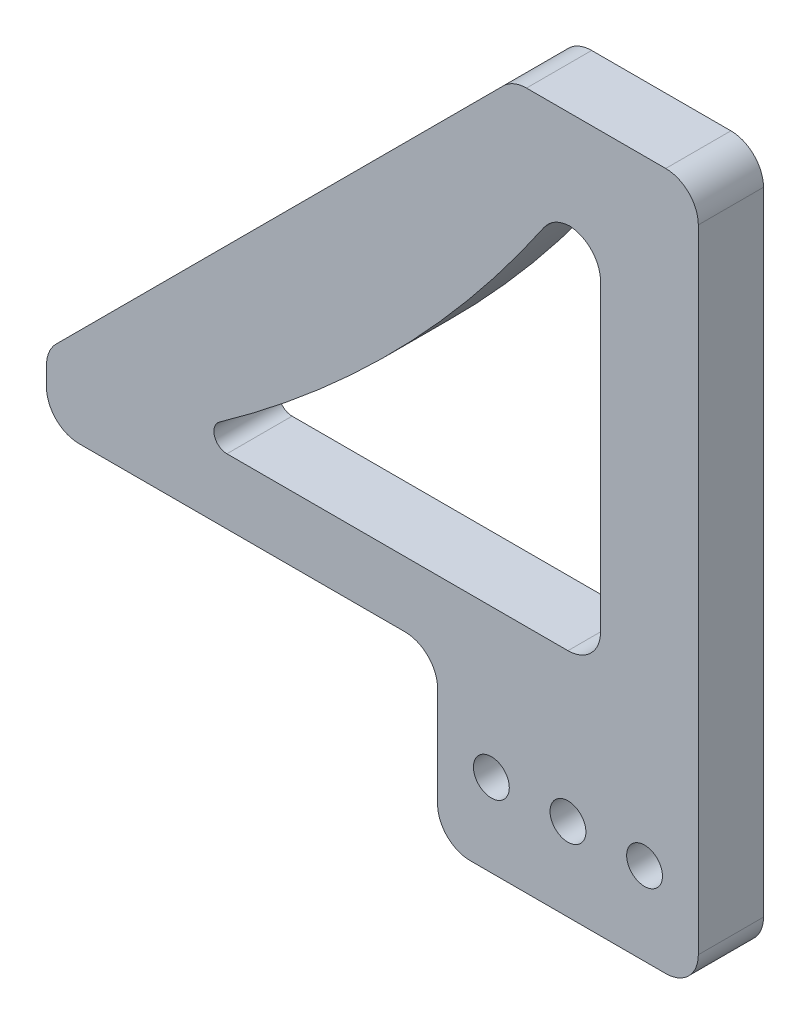
ISO-10303-21;
HEADER;
FILE_DESCRIPTION(('STEP AP214'),'2;1');
FILE_NAME('part.step','',(''),(''),'','','');
FILE_SCHEMA(('AUTOMOTIVE_DESIGN { 1 0 10303 214 1 1 1 1 }'));
ENDSEC;
DATA;
#1=APPLICATION_CONTEXT('core data for automotive mechanical design processes');
#2=APPLICATION_PROTOCOL_DEFINITION('international standard','automotive_design',2000,#1);
#3=PRODUCT_CONTEXT('',#1,'mechanical');
#4=PRODUCT('Part','Part','',(#3));
#5=PRODUCT_RELATED_PRODUCT_CATEGORY('part','',(#4));
#6=PRODUCT_DEFINITION_FORMATION('','',#4);
#7=PRODUCT_DEFINITION_CONTEXT('part definition',#1,'design');
#8=PRODUCT_DEFINITION('design','',#6,#7);
#9=PRODUCT_DEFINITION_SHAPE('','',#8);
#10=(LENGTH_UNIT() NAMED_UNIT(*) SI_UNIT(.MILLI.,.METRE.));
#11=(NAMED_UNIT(*) PLANE_ANGLE_UNIT() SI_UNIT($,.RADIAN.));
#12=(NAMED_UNIT(*) SI_UNIT($,.STERADIAN.) SOLID_ANGLE_UNIT());
#13=UNCERTAINTY_MEASURE_WITH_UNIT(LENGTH_MEASURE(1.E-05),#10,'distance_accuracy_value','');
#14=(GEOMETRIC_REPRESENTATION_CONTEXT(3) GLOBAL_UNCERTAINTY_ASSIGNED_CONTEXT((#13)) GLOBAL_UNIT_ASSIGNED_CONTEXT((#10,
#11,#12)) REPRESENTATION_CONTEXT('',''));
#15=CARTESIAN_POINT('',(0.,0.,0.));
#16=DIRECTION('',(0.,0.,1.));
#17=DIRECTION('',(1.,0.,0.));
#18=AXIS2_PLACEMENT_3D('',#15,#16,#17);
#19=CARTESIAN_POINT('',(0.,0.,10.));
#20=DIRECTION('',(0.,0.,-1.));
#21=DIRECTION('',(-1.,0.,0.));
#22=AXIS2_PLACEMENT_3D('',#19,#20,#21);
#23=PLANE('',#22);
#24=DIRECTION('',(0.,-1.,0.));
#25=VECTOR('',#24,1.);
#26=CARTESIAN_POINT('',(-60.,0.,10.));
#27=LINE('',#26,#25);
#28=CARTESIAN_POINT('',(-60.,7.92893218813452,10.));
#29=VERTEX_POINT('',#28);
#30=CARTESIAN_POINT('',(-60.,4.99999999999999,10.));
#31=VERTEX_POINT('',#30);
#32=EDGE_CURVE('E320',#29,#31,#27,.T.);
#33=ORIENTED_EDGE('',*,*,#32,.T.);
#34=CARTESIAN_POINT('',(-55.,4.99999999999999,10.));
#35=DIRECTION('',(0.,0.,-1.));
#36=DIRECTION('',(-1.,0.,0.));
#37=AXIS2_PLACEMENT_3D('',#34,#35,#36);
#38=CIRCLE('',#37,5.);
#39=CARTESIAN_POINT('',(-55.,0.,10.));
#40=VERTEX_POINT('',#39);
#41=EDGE_CURVE('E252',#31,#40,#38,.F.);
#42=ORIENTED_EDGE('',*,*,#41,.T.);
#43=DIRECTION('',(1.,0.,0.));
#44=VECTOR('',#43,1.);
#45=CARTESIAN_POINT('',(0.,0.,10.));
#46=LINE('',#45,#44);
#47=CARTESIAN_POINT('',(-5.,0.,10.));
#48=VERTEX_POINT('',#47);
#49=EDGE_CURVE('E323',#40,#48,#46,.T.);
#50=ORIENTED_EDGE('',*,*,#49,.T.);
#51=CARTESIAN_POINT('',(-5.,-5.,10.));
#52=DIRECTION('',(0.,0.,-1.));
#53=DIRECTION('',(-1.,0.,0.));
#54=AXIS2_PLACEMENT_3D('',#51,#52,#53);
#55=CIRCLE('',#54,5.);
#56=CARTESIAN_POINT('',(0.,-5.,10.));
#57=VERTEX_POINT('',#56);
#58=EDGE_CURVE('E284',#48,#57,#55,.T.);
#59=ORIENTED_EDGE('',*,*,#58,.T.);
#60=DIRECTION('',(0.,-1.,0.));
#61=VECTOR('',#60,1.);
#62=CARTESIAN_POINT('',(0.,-25.4,10.));
#63=LINE('',#62,#61);
#64=CARTESIAN_POINT('',(0.,-20.4,10.));
#65=VERTEX_POINT('',#64);
#66=EDGE_CURVE('E326',#57,#65,#63,.T.);
#67=ORIENTED_EDGE('',*,*,#66,.T.);
#68=CARTESIAN_POINT('',(5.,-20.4,10.));
#69=DIRECTION('',(0.,0.,-1.));
#70=DIRECTION('',(-1.,0.,0.));
#71=AXIS2_PLACEMENT_3D('',#68,#69,#70);
#72=CIRCLE('',#71,5.);
#73=CARTESIAN_POINT('',(5.,-25.4,10.));
#74=VERTEX_POINT('',#73);
#75=EDGE_CURVE('E248',#65,#74,#72,.F.);
#76=ORIENTED_EDGE('',*,*,#75,.T.);
#77=DIRECTION('',(1.,0.,0.));
#78=VECTOR('',#77,1.);
#79=CARTESIAN_POINT('',(40.,-25.4,10.));
#80=LINE('',#79,#78);
#81=CARTESIAN_POINT('',(35.,-25.4,10.));
#82=VERTEX_POINT('',#81);
#83=EDGE_CURVE('E329',#74,#82,#80,.T.);
#84=ORIENTED_EDGE('',*,*,#83,.T.);
#85=CARTESIAN_POINT('',(35.,-20.4,10.));
#86=DIRECTION('',(0.,0.,-1.));
#87=DIRECTION('',(-1.,0.,0.));
#88=AXIS2_PLACEMENT_3D('',#85,#86,#87);
#89=CIRCLE('',#88,5.);
#90=CARTESIAN_POINT('',(40.,-20.4,10.));
#91=VERTEX_POINT('',#90);
#92=EDGE_CURVE('E246',#82,#91,#89,.F.);
#93=ORIENTED_EDGE('',*,*,#92,.T.);
#94=DIRECTION('',(0.,1.,0.));
#95=VECTOR('',#94,1.);
#96=CARTESIAN_POINT('',(40.,81.5685424949238,10.));
#97=LINE('',#96,#95);
#98=CARTESIAN_POINT('',(40.,76.5685424949238,10.));
#99=VERTEX_POINT('',#98);
#100=EDGE_CURVE('E332',#91,#99,#97,.T.);
#101=ORIENTED_EDGE('',*,*,#100,.T.);
#102=CARTESIAN_POINT('',(35.,76.5685424949238,10.));
#103=DIRECTION('',(0.,0.,-1.));
#104=DIRECTION('',(-1.,0.,0.));
#105=AXIS2_PLACEMENT_3D('',#102,#103,#104);
#106=CIRCLE('',#105,5.);
#107=CARTESIAN_POINT('',(35.,81.5685424949238,10.));
#108=VERTEX_POINT('',#107);
#109=EDGE_CURVE('E244',#99,#108,#106,.F.);
#110=ORIENTED_EDGE('',*,*,#109,.T.);
#111=DIRECTION('',(-1.,0.,0.));
#112=VECTOR('',#111,1.);
#113=CARTESIAN_POINT('',(11.5685424949238,81.5685424949238,10.));
#114=LINE('',#113,#112);
#115=CARTESIAN_POINT('',(13.6396103067893,81.5685424949238,10.));
#116=VERTEX_POINT('',#115);
#117=EDGE_CURVE('E205',#108,#116,#114,.T.);
#118=ORIENTED_EDGE('',*,*,#117,.T.);
#119=CARTESIAN_POINT('',(13.6396103067893,76.5685424949238,10.));
#120=DIRECTION('',(0.,0.,-1.));
#121=DIRECTION('',(-1.,0.,0.));
#122=AXIS2_PLACEMENT_3D('',#119,#120,#121);
#123=CIRCLE('',#122,5.);
#124=CARTESIAN_POINT('',(10.1040764008565,80.1040764008565,10.));
#125=VERTEX_POINT('',#124);
#126=EDGE_CURVE('E242',#116,#125,#123,.F.);
#127=ORIENTED_EDGE('',*,*,#126,.T.);
#128=DIRECTION('',(-0.707106781186547,-0.707106781186548,0.));
#129=VECTOR('',#128,1.);
#130=CARTESIAN_POINT('',(-60.,10.,10.));
#131=LINE('',#130,#129);
#132=CARTESIAN_POINT('',(-58.5355339059327,11.4644660940673,10.));
#133=VERTEX_POINT('',#132);
#134=EDGE_CURVE('E200',#125,#133,#131,.T.);
#135=ORIENTED_EDGE('',*,*,#134,.T.);
#136=CARTESIAN_POINT('',(-55.,7.92893218813452,10.));
#137=DIRECTION('',(0.,0.,-1.));
#138=DIRECTION('',(-1.,0.,0.));
#139=AXIS2_PLACEMENT_3D('',#136,#137,#138);
#140=CIRCLE('',#139,5.);
#141=EDGE_CURVE('E250',#133,#29,#140,.F.);
#142=ORIENTED_EDGE('',*,*,#141,.T.);
#143=EDGE_LOOP('',(#33,#42,#50,#59,#67,#76,#84,#93,#101,#110,#118,#127,#135,#142));
#144=FACE_BOUND('',#143,.T.);
#145=CARTESIAN_POINT('',(20.4491003346028,61.5685424949238,10.));
#146=DIRECTION('',(0.,0.,-1.));
#147=DIRECTION('',(-1.,0.,0.));
#148=AXIS2_PLACEMENT_3D('',#145,#146,#147);
#149=CIRCLE('',#148,5.);
#150=CARTESIAN_POINT('',(16.3145713039429,64.3802447719494,10.));
#151=VERTEX_POINT('',#150);
#152=CARTESIAN_POINT('',(20.2245501673013,66.5634976721366,10.));
#153=VERTEX_POINT('',#152);
#154=EDGE_CURVE('E183',#151,#153,#149,.T.);
#155=ORIENTED_EDGE('',*,*,#154,.T.);
#156=CARTESIAN_POINT('',(20.,61.5685424949238,10.));
#157=DIRECTION('',(0.,0.,-1.));
#158=DIRECTION('',(-1.,0.,0.));
#159=AXIS2_PLACEMENT_3D('',#156,#157,#158);
#160=CIRCLE('',#159,5.);
#161=CARTESIAN_POINT('',(25.,61.5685424949238,10.));
#162=VERTEX_POINT('',#161);
#163=EDGE_CURVE('E275',#153,#162,#160,.T.);
#164=ORIENTED_EDGE('',*,*,#163,.T.);
#165=DIRECTION('',(0.,1.,0.));
#166=VECTOR('',#165,1.);
#167=CARTESIAN_POINT('',(25.,66.5685424949238,10.));
#168=LINE('',#167,#166);
#169=CARTESIAN_POINT('',(25.,15.,10.));
#170=VERTEX_POINT('',#169);
#171=EDGE_CURVE('E314',#170,#162,#168,.T.);
#172=ORIENTED_EDGE('',*,*,#171,.F.);
#173=CARTESIAN_POINT('',(20.,15.,10.));
#174=DIRECTION('',(0.,0.,-1.));
#175=DIRECTION('',(-1.,0.,0.));
#176=AXIS2_PLACEMENT_3D('',#173,#174,#175);
#177=CIRCLE('',#176,5.);
#178=CARTESIAN_POINT('',(20.,10.,10.));
#179=VERTEX_POINT('',#178);
#180=EDGE_CURVE('E279',#170,#179,#177,.T.);
#181=ORIENTED_EDGE('',*,*,#180,.T.);
#182=DIRECTION('',(1.,0.,0.));
#183=VECTOR('',#182,1.);
#184=CARTESIAN_POINT('',(25.,10.,10.));
#185=LINE('',#184,#183);
#186=CARTESIAN_POINT('',(-32.3231696945618,10.,10.));
#187=VERTEX_POINT('',#186);
#188=EDGE_CURVE('E311',#187,#179,#185,.T.);
#189=ORIENTED_EDGE('',*,*,#188,.F.);
#190=CARTESIAN_POINT('',(-32.3231696945618,12.,10.));
#191=DIRECTION('',(0.,0.,-1.));
#192=DIRECTION('',(-1.,0.,0.));
#193=AXIS2_PLACEMENT_3D('',#190,#191,#192);
#194=CIRCLE('',#193,2.);
#195=CARTESIAN_POINT('',(-33.4790451423627,13.6321617411185,10.));
#196=VERTEX_POINT('',#195);
#197=EDGE_CURVE('E11',#187,#196,#194,.T.);
#198=ORIENTED_EDGE('',*,*,#197,.T.);
#199=CARTESIAN_POINT('',(-149.066589922452,176.848335852972,10.));
#200=DIRECTION('',(0.,0.,-1.));
#201=DIRECTION('',(-1.,0.,0.));
#202=AXIS2_PLACEMENT_3D('',#199,#200,#201);
#203=CIRCLE('',#202,200.);
#204=EDGE_CURVE('E309',#151,#196,#203,.T.);
#205=ORIENTED_EDGE('',*,*,#204,.F.);
#206=EDGE_LOOP('',(#155,#164,#172,#181,#189,#198,#205));
#207=FACE_BOUND('',#206,.T.);
#208=CARTESIAN_POINT('',(8.25,-12.7,10.));
#209=DIRECTION('',(0.,0.,1.));
#210=DIRECTION('',(1.,0.,0.));
#211=AXIS2_PLACEMENT_3D('',#208,#209,#210);
#212=CIRCLE('',#211,2.75);
#213=CARTESIAN_POINT('',(11.,-12.7,10.));
#214=VERTEX_POINT('',#213);
#215=EDGE_CURVE('E196',#214,#214,#212,.T.);
#216=ORIENTED_EDGE('',*,*,#215,.F.);
#217=EDGE_LOOP('',(#216));
#218=FACE_BOUND('',#217,.T.);
#219=CARTESIAN_POINT('',(20.,-12.7,10.));
#220=DIRECTION('',(0.,0.,1.));
#221=DIRECTION('',(1.,0.,0.));
#222=AXIS2_PLACEMENT_3D('',#219,#220,#221);
#223=CIRCLE('',#222,2.75);
#224=CARTESIAN_POINT('',(22.75,-12.7,10.));
#225=VERTEX_POINT('',#224);
#226=EDGE_CURVE('E299',#225,#225,#223,.T.);
#227=ORIENTED_EDGE('',*,*,#226,.F.);
#228=EDGE_LOOP('',(#227));
#229=FACE_BOUND('',#228,.T.);
#230=CARTESIAN_POINT('',(31.75,-12.7,10.));
#231=DIRECTION('',(0.,0.,1.));
#232=DIRECTION('',(1.,0.,0.));
#233=AXIS2_PLACEMENT_3D('',#230,#231,#232);
#234=CIRCLE('',#233,2.75);
#235=CARTESIAN_POINT('',(34.5,-12.7,10.));
#236=VERTEX_POINT('',#235);
#237=EDGE_CURVE('E291',#236,#236,#234,.T.);
#238=ORIENTED_EDGE('',*,*,#237,.F.);
#239=EDGE_LOOP('',(#238));
#240=FACE_BOUND('',#239,.T.);
#241=ADVANCED_FACE('F32',(#144,#207,#218,#229,#240),#23,.F.);
#242=CARTESIAN_POINT('',(0.,0.,0.));
#243=DIRECTION('',(0.,0.,-1.));
#244=DIRECTION('',(-1.,0.,0.));
#245=AXIS2_PLACEMENT_3D('',#242,#243,#244);
#246=PLANE('',#245);
#247=CARTESIAN_POINT('',(20.,-12.7,0.));
#248=DIRECTION('',(0.,0.,1.));
#249=DIRECTION('',(1.,0.,0.));
#250=AXIS2_PLACEMENT_3D('',#247,#248,#249);
#251=CIRCLE('',#250,2.75);
#252=CARTESIAN_POINT('',(22.75,-12.7,0.));
#253=VERTEX_POINT('',#252);
#254=EDGE_CURVE('E296',#253,#253,#251,.T.);
#255=ORIENTED_EDGE('',*,*,#254,.T.);
#256=EDGE_LOOP('',(#255));
#257=FACE_BOUND('',#256,.T.);
#258=DIRECTION('',(0.,1.,0.));
#259=VECTOR('',#258,1.);
#260=CARTESIAN_POINT('',(25.,66.5685424949238,0.));
#261=LINE('',#260,#259);
#262=CARTESIAN_POINT('',(25.,15.,0.));
#263=VERTEX_POINT('',#262);
#264=CARTESIAN_POINT('',(25.,61.5685424949238,0.));
#265=VERTEX_POINT('',#264);
#266=EDGE_CURVE('E312',#263,#265,#261,.T.);
#267=ORIENTED_EDGE('',*,*,#266,.T.);
#268=CARTESIAN_POINT('',(20.,61.5685424949238,0.));
#269=DIRECTION('',(0.,0.,-1.));
#270=DIRECTION('',(-1.,0.,0.));
#271=AXIS2_PLACEMENT_3D('',#268,#269,#270);
#272=CIRCLE('',#271,5.);
#273=CARTESIAN_POINT('',(20.2245501673013,66.5634976721366,0.));
#274=VERTEX_POINT('',#273);
#275=EDGE_CURVE('E178',#265,#274,#272,.F.);
#276=ORIENTED_EDGE('',*,*,#275,.T.);
#277=CARTESIAN_POINT('',(20.4491003346028,61.5685424949238,0.));
#278=DIRECTION('',(0.,0.,-1.));
#279=DIRECTION('',(-1.,0.,0.));
#280=AXIS2_PLACEMENT_3D('',#277,#278,#279);
#281=CIRCLE('',#280,5.);
#282=CARTESIAN_POINT('',(16.3145713039429,64.3802447719494,0.));
#283=VERTEX_POINT('',#282);
#284=EDGE_CURVE('E171',#274,#283,#281,.F.);
#285=ORIENTED_EDGE('',*,*,#284,.T.);
#286=CARTESIAN_POINT('',(-149.066589922452,176.848335852972,0.));
#287=DIRECTION('',(0.,0.,-1.));
#288=DIRECTION('',(-1.,0.,0.));
#289=AXIS2_PLACEMENT_3D('',#286,#287,#288);
#290=CIRCLE('',#289,200.);
#291=CARTESIAN_POINT('',(-33.4790451423627,13.6321617411185,0.));
#292=VERTEX_POINT('',#291);
#293=EDGE_CURVE('E176',#283,#292,#290,.T.);
#294=ORIENTED_EDGE('',*,*,#293,.T.);
#295=CARTESIAN_POINT('',(-32.3231696945618,12.,0.));
#296=DIRECTION('',(0.,0.,-1.));
#297=DIRECTION('',(-1.,0.,0.));
#298=AXIS2_PLACEMENT_3D('',#295,#296,#297);
#299=CIRCLE('',#298,2.);
#300=CARTESIAN_POINT('',(-32.3231696945618,10.,0.));
#301=VERTEX_POINT('',#300);
#302=EDGE_CURVE('E40',#292,#301,#299,.F.);
#303=ORIENTED_EDGE('',*,*,#302,.T.);
#304=DIRECTION('',(1.,0.,0.));
#305=VECTOR('',#304,1.);
#306=CARTESIAN_POINT('',(25.,10.,0.));
#307=LINE('',#306,#305);
#308=CARTESIAN_POINT('',(20.,10.,0.));
#309=VERTEX_POINT('',#308);
#310=EDGE_CURVE('E195',#301,#309,#307,.T.);
#311=ORIENTED_EDGE('',*,*,#310,.T.);
#312=CARTESIAN_POINT('',(20.,15.,0.));
#313=DIRECTION('',(0.,0.,-1.));
#314=DIRECTION('',(-1.,0.,0.));
#315=AXIS2_PLACEMENT_3D('',#312,#313,#314);
#316=CIRCLE('',#315,5.);
#317=EDGE_CURVE('E277',#309,#263,#316,.F.);
#318=ORIENTED_EDGE('',*,*,#317,.T.);
#319=EDGE_LOOP('',(#267,#276,#285,#294,#303,#311,#318));
#320=FACE_BOUND('',#319,.T.);
#321=DIRECTION('',(1.,0.,0.));
#322=VECTOR('',#321,1.);
#323=CARTESIAN_POINT('',(0.,0.,0.));
#324=LINE('',#323,#322);
#325=CARTESIAN_POINT('',(-55.,0.,0.));
#326=VERTEX_POINT('',#325);
#327=CARTESIAN_POINT('',(-5.,0.,0.));
#328=VERTEX_POINT('',#327);
#329=EDGE_CURVE('E339',#326,#328,#324,.T.);
#330=ORIENTED_EDGE('',*,*,#329,.F.);
#331=CARTESIAN_POINT('',(-55.,4.99999999999999,0.));
#332=DIRECTION('',(0.,0.,-1.));
#333=DIRECTION('',(-1.,0.,0.));
#334=AXIS2_PLACEMENT_3D('',#331,#332,#333);
#335=CIRCLE('',#334,5.);
#336=CARTESIAN_POINT('',(-60.,4.99999999999999,0.));
#337=VERTEX_POINT('',#336);
#338=EDGE_CURVE('E235',#326,#337,#335,.T.);
#339=ORIENTED_EDGE('',*,*,#338,.T.);
#340=DIRECTION('',(0.,-1.,0.));
#341=VECTOR('',#340,1.);
#342=CARTESIAN_POINT('',(-60.,0.,0.));
#343=LINE('',#342,#341);
#344=CARTESIAN_POINT('',(-60.,7.92893218813452,0.));
#345=VERTEX_POINT('',#344);
#346=EDGE_CURVE('E316',#345,#337,#343,.T.);
#347=ORIENTED_EDGE('',*,*,#346,.F.);
#348=CARTESIAN_POINT('',(-55.,7.92893218813452,0.));
#349=DIRECTION('',(0.,0.,-1.));
#350=DIRECTION('',(-1.,0.,0.));
#351=AXIS2_PLACEMENT_3D('',#348,#349,#350);
#352=CIRCLE('',#351,5.);
#353=CARTESIAN_POINT('',(-58.5355339059327,11.4644660940673,0.));
#354=VERTEX_POINT('',#353);
#355=EDGE_CURVE('E233',#345,#354,#352,.T.);
#356=ORIENTED_EDGE('',*,*,#355,.T.);
#357=DIRECTION('',(-0.707106781186547,-0.707106781186548,0.));
#358=VECTOR('',#357,1.);
#359=CARTESIAN_POINT('',(-60.,10.,0.));
#360=LINE('',#359,#358);
#361=CARTESIAN_POINT('',(10.1040764008565,80.1040764008565,0.));
#362=VERTEX_POINT('',#361);
#363=EDGE_CURVE('E208',#362,#354,#360,.T.);
#364=ORIENTED_EDGE('',*,*,#363,.F.);
#365=CARTESIAN_POINT('',(13.6396103067893,76.5685424949238,0.));
#366=DIRECTION('',(0.,0.,-1.));
#367=DIRECTION('',(-1.,0.,0.));
#368=AXIS2_PLACEMENT_3D('',#365,#366,#367);
#369=CIRCLE('',#368,5.);
#370=CARTESIAN_POINT('',(13.6396103067893,81.5685424949238,0.));
#371=VERTEX_POINT('',#370);
#372=EDGE_CURVE('E225',#362,#371,#369,.T.);
#373=ORIENTED_EDGE('',*,*,#372,.T.);
#374=DIRECTION('',(-1.,0.,0.));
#375=VECTOR('',#374,1.);
#376=CARTESIAN_POINT('',(11.5685424949238,81.5685424949238,0.));
#377=LINE('',#376,#375);
#378=CARTESIAN_POINT('',(35.,81.5685424949238,0.));
#379=VERTEX_POINT('',#378);
#380=EDGE_CURVE('E350',#379,#371,#377,.T.);
#381=ORIENTED_EDGE('',*,*,#380,.F.);
#382=CARTESIAN_POINT('',(35.,76.5685424949238,0.));
#383=DIRECTION('',(0.,0.,-1.));
#384=DIRECTION('',(-1.,0.,0.));
#385=AXIS2_PLACEMENT_3D('',#382,#383,#384);
#386=CIRCLE('',#385,5.);
#387=CARTESIAN_POINT('',(40.,76.5685424949238,0.));
#388=VERTEX_POINT('',#387);
#389=EDGE_CURVE('E227',#379,#388,#386,.T.);
#390=ORIENTED_EDGE('',*,*,#389,.T.);
#391=DIRECTION('',(0.,1.,0.));
#392=VECTOR('',#391,1.);
#393=CARTESIAN_POINT('',(40.,81.5685424949238,0.));
#394=LINE('',#393,#392);
#395=CARTESIAN_POINT('',(40.,-20.4,0.));
#396=VERTEX_POINT('',#395);
#397=EDGE_CURVE('E348',#396,#388,#394,.T.);
#398=ORIENTED_EDGE('',*,*,#397,.F.);
#399=CARTESIAN_POINT('',(35.,-20.4,0.));
#400=DIRECTION('',(0.,0.,-1.));
#401=DIRECTION('',(-1.,0.,0.));
#402=AXIS2_PLACEMENT_3D('',#399,#400,#401);
#403=CIRCLE('',#402,5.);
#404=CARTESIAN_POINT('',(35.,-25.4,0.));
#405=VERTEX_POINT('',#404);
#406=EDGE_CURVE('E229',#396,#405,#403,.T.);
#407=ORIENTED_EDGE('',*,*,#406,.T.);
#408=DIRECTION('',(1.,0.,0.));
#409=VECTOR('',#408,1.);
#410=CARTESIAN_POINT('',(40.,-25.4,0.));
#411=LINE('',#410,#409);
#412=CARTESIAN_POINT('',(5.,-25.4,0.));
#413=VERTEX_POINT('',#412);
#414=EDGE_CURVE('E345',#413,#405,#411,.T.);
#415=ORIENTED_EDGE('',*,*,#414,.F.);
#416=CARTESIAN_POINT('',(5.,-20.4,0.));
#417=DIRECTION('',(0.,0.,-1.));
#418=DIRECTION('',(-1.,0.,0.));
#419=AXIS2_PLACEMENT_3D('',#416,#417,#418);
#420=CIRCLE('',#419,5.);
#421=CARTESIAN_POINT('',(0.,-20.4,0.));
#422=VERTEX_POINT('',#421);
#423=EDGE_CURVE('E231',#413,#422,#420,.T.);
#424=ORIENTED_EDGE('',*,*,#423,.T.);
#425=DIRECTION('',(0.,-1.,0.));
#426=VECTOR('',#425,1.);
#427=CARTESIAN_POINT('',(0.,-25.4,0.));
#428=LINE('',#427,#426);
#429=CARTESIAN_POINT('',(0.,-5.,0.));
#430=VERTEX_POINT('',#429);
#431=EDGE_CURVE('E342',#430,#422,#428,.T.);
#432=ORIENTED_EDGE('',*,*,#431,.F.);
#433=CARTESIAN_POINT('',(-5.,-5.,0.));
#434=DIRECTION('',(0.,0.,-1.));
#435=DIRECTION('',(-1.,0.,0.));
#436=AXIS2_PLACEMENT_3D('',#433,#434,#435);
#437=CIRCLE('',#436,5.);
#438=EDGE_CURVE('E282',#430,#328,#437,.F.);
#439=ORIENTED_EDGE('',*,*,#438,.T.);
#440=EDGE_LOOP('',(#330,#339,#347,#356,#364,#373,#381,#390,#398,#407,#415,#424,#432,#439));
#441=FACE_BOUND('',#440,.T.);
#442=CARTESIAN_POINT('',(8.25,-12.7,0.));
#443=DIRECTION('',(0.,0.,1.));
#444=DIRECTION('',(1.,0.,0.));
#445=AXIS2_PLACEMENT_3D('',#442,#443,#444);
#446=CIRCLE('',#445,2.75);
#447=CARTESIAN_POINT('',(11.,-12.7,0.));
#448=VERTEX_POINT('',#447);
#449=EDGE_CURVE('E302',#448,#448,#446,.T.);
#450=ORIENTED_EDGE('',*,*,#449,.T.);
#451=EDGE_LOOP('',(#450));
#452=FACE_BOUND('',#451,.T.);
#453=CARTESIAN_POINT('',(31.75,-12.7,0.));
#454=DIRECTION('',(0.,0.,1.));
#455=DIRECTION('',(1.,0.,0.));
#456=AXIS2_PLACEMENT_3D('',#453,#454,#455);
#457=CIRCLE('',#456,2.75);
#458=CARTESIAN_POINT('',(34.5,-12.7,0.));
#459=VERTEX_POINT('',#458);
#460=EDGE_CURVE('E288',#459,#459,#457,.T.);
#461=ORIENTED_EDGE('',*,*,#460,.T.);
#462=EDGE_LOOP('',(#461));
#463=FACE_BOUND('',#462,.T.);
#464=ADVANCED_FACE('F174',(#257,#320,#441,#452,#463),#246,.T.);
#465=CARTESIAN_POINT('',(-60.,0.,10.));
#466=DIRECTION('',(1.,0.,0.));
#467=DIRECTION('',(0.,0.,-1.));
#468=AXIS2_PLACEMENT_3D('',#465,#466,#467);
#469=PLANE('',#468);
#470=ORIENTED_EDGE('',*,*,#346,.T.);
#471=DIRECTION('',(0.,0.,-1.));
#472=VECTOR('',#471,1.);
#473=CARTESIAN_POINT('',(-60.,4.99999999999999,10.));
#474=LINE('',#473,#472);
#475=EDGE_CURVE('E240',#337,#31,#474,.F.);
#476=ORIENTED_EDGE('',*,*,#475,.T.);
#477=ORIENTED_EDGE('',*,*,#32,.F.);
#478=DIRECTION('',(0.,0.,-1.));
#479=VECTOR('',#478,1.);
#480=CARTESIAN_POINT('',(-60.,7.92893218813452,10.));
#481=LINE('',#480,#479);
#482=EDGE_CURVE('E237',#29,#345,#481,.T.);
#483=ORIENTED_EDGE('',*,*,#482,.T.);
#484=EDGE_LOOP('',(#470,#476,#477,#483));
#485=FACE_BOUND('',#484,.T.);
#486=ADVANCED_FACE('F371',(#485),#469,.F.);
#487=CARTESIAN_POINT('',(0.,0.,10.));
#488=DIRECTION('',(0.,1.,0.));
#489=DIRECTION('',(-1.,0.,0.));
#490=AXIS2_PLACEMENT_3D('',#487,#488,#489);
#491=PLANE('',#490);
#492=ORIENTED_EDGE('',*,*,#329,.T.);
#493=DIRECTION('',(0.,0.,-1.));
#494=VECTOR('',#493,1.);
#495=CARTESIAN_POINT('',(-5.,0.,10.));
#496=LINE('',#495,#494);
#497=EDGE_CURVE('E223',#328,#48,#496,.F.);
#498=ORIENTED_EDGE('',*,*,#497,.T.);
#499=ORIENTED_EDGE('',*,*,#49,.F.);
#500=DIRECTION('',(0.,0.,-1.));
#501=VECTOR('',#500,1.);
#502=CARTESIAN_POINT('',(-55.,0.,10.));
#503=LINE('',#502,#501);
#504=EDGE_CURVE('E220',#40,#326,#503,.T.);
#505=ORIENTED_EDGE('',*,*,#504,.T.);
#506=EDGE_LOOP('',(#492,#498,#499,#505));
#507=FACE_BOUND('',#506,.T.);
#508=ADVANCED_FACE('F380',(#507),#491,.F.);
#509=CARTESIAN_POINT('',(0.,-25.4,10.));
#510=DIRECTION('',(1.,0.,0.));
#511=DIRECTION('',(0.,0.,-1.));
#512=AXIS2_PLACEMENT_3D('',#509,#510,#511);
#513=PLANE('',#512);
#514=ORIENTED_EDGE('',*,*,#66,.F.);
#515=DIRECTION('',(0.,0.,-1.));
#516=VECTOR('',#515,1.);
#517=CARTESIAN_POINT('',(0.,-5.,0.));
#518=LINE('',#517,#516);
#519=EDGE_CURVE('E217',#57,#430,#518,.T.);
#520=ORIENTED_EDGE('',*,*,#519,.T.);
#521=ORIENTED_EDGE('',*,*,#431,.T.);
#522=DIRECTION('',(0.,0.,-1.));
#523=VECTOR('',#522,1.);
#524=CARTESIAN_POINT('',(0.,-20.4,10.));
#525=LINE('',#524,#523);
#526=EDGE_CURVE('E215',#422,#65,#525,.F.);
#527=ORIENTED_EDGE('',*,*,#526,.T.);
#528=EDGE_LOOP('',(#514,#520,#521,#527));
#529=FACE_BOUND('',#528,.T.);
#530=ADVANCED_FACE('F389',(#529),#513,.F.);
#531=CARTESIAN_POINT('',(40.,-25.4,10.));
#532=DIRECTION('',(0.,1.,0.));
#533=DIRECTION('',(-1.,0.,0.));
#534=AXIS2_PLACEMENT_3D('',#531,#532,#533);
#535=PLANE('',#534);
#536=ORIENTED_EDGE('',*,*,#83,.F.);
#537=DIRECTION('',(0.,0.,-1.));
#538=VECTOR('',#537,1.);
#539=CARTESIAN_POINT('',(5.,-25.4,10.));
#540=LINE('',#539,#538);
#541=EDGE_CURVE('E261',#74,#413,#540,.T.);
#542=ORIENTED_EDGE('',*,*,#541,.T.);
#543=ORIENTED_EDGE('',*,*,#414,.T.);
#544=DIRECTION('',(0.,0.,-1.));
#545=VECTOR('',#544,1.);
#546=CARTESIAN_POINT('',(35.,-25.4,10.));
#547=LINE('',#546,#545);
#548=EDGE_CURVE('E259',#405,#82,#547,.F.);
#549=ORIENTED_EDGE('',*,*,#548,.T.);
#550=EDGE_LOOP('',(#536,#542,#543,#549));
#551=FACE_BOUND('',#550,.T.);
#552=ADVANCED_FACE('F398',(#551),#535,.F.);
#553=CARTESIAN_POINT('',(40.,81.5685424949238,10.));
#554=DIRECTION('',(-1.,0.,0.));
#555=DIRECTION('',(0.,0.,1.));
#556=AXIS2_PLACEMENT_3D('',#553,#554,#555);
#557=PLANE('',#556);
#558=ORIENTED_EDGE('',*,*,#100,.F.);
#559=DIRECTION('',(0.,0.,-1.));
#560=VECTOR('',#559,1.);
#561=CARTESIAN_POINT('',(40.,-20.4,10.));
#562=LINE('',#561,#560);
#563=EDGE_CURVE('E266',#91,#396,#562,.T.);
#564=ORIENTED_EDGE('',*,*,#563,.T.);
#565=ORIENTED_EDGE('',*,*,#397,.T.);
#566=DIRECTION('',(0.,0.,-1.));
#567=VECTOR('',#566,1.);
#568=CARTESIAN_POINT('',(40.,76.5685424949238,10.));
#569=LINE('',#568,#567);
#570=EDGE_CURVE('E264',#388,#99,#569,.F.);
#571=ORIENTED_EDGE('',*,*,#570,.T.);
#572=EDGE_LOOP('',(#558,#564,#565,#571));
#573=FACE_BOUND('',#572,.T.);
#574=ADVANCED_FACE('F407',(#573),#557,.F.);
#575=CARTESIAN_POINT('',(11.5685424949238,81.5685424949238,10.));
#576=DIRECTION('',(0.,-1.,0.));
#577=DIRECTION('',(1.,0.,0.));
#578=AXIS2_PLACEMENT_3D('',#575,#576,#577);
#579=PLANE('',#578);
#580=ORIENTED_EDGE('',*,*,#117,.F.);
#581=DIRECTION('',(0.,0.,-1.));
#582=VECTOR('',#581,1.);
#583=CARTESIAN_POINT('',(35.,81.5685424949238,10.));
#584=LINE('',#583,#582);
#585=EDGE_CURVE('E184',#108,#379,#584,.T.);
#586=ORIENTED_EDGE('',*,*,#585,.T.);
#587=ORIENTED_EDGE('',*,*,#380,.T.);
#588=DIRECTION('',(0.,0.,-1.));
#589=VECTOR('',#588,1.);
#590=CARTESIAN_POINT('',(13.6396103067893,81.5685424949238,10.));
#591=LINE('',#590,#589);
#592=EDGE_CURVE('E269',#371,#116,#591,.F.);
#593=ORIENTED_EDGE('',*,*,#592,.T.);
#594=EDGE_LOOP('',(#580,#586,#587,#593));
#595=FACE_BOUND('',#594,.T.);
#596=ADVANCED_FACE('F415',(#595),#579,.F.);
#597=CARTESIAN_POINT('',(-60.,10.,10.));
#598=DIRECTION('',(0.707106781186548,-0.707106781186547,0.));
#599=DIRECTION('',(0.707106781186547,0.707106781186548,0.));
#600=AXIS2_PLACEMENT_3D('',#597,#598,#599);
#601=PLANE('',#600);
#602=ORIENTED_EDGE('',*,*,#363,.T.);
#603=DIRECTION('',(0.,0.,-1.));
#604=VECTOR('',#603,1.);
#605=CARTESIAN_POINT('',(-58.5355339059327,11.4644660940673,10.));
#606=LINE('',#605,#604);
#607=EDGE_CURVE('E257',#354,#133,#606,.F.);
#608=ORIENTED_EDGE('',*,*,#607,.T.);
#609=ORIENTED_EDGE('',*,*,#134,.F.);
#610=DIRECTION('',(0.,0.,-1.));
#611=VECTOR('',#610,1.);
#612=CARTESIAN_POINT('',(10.1040764008565,80.1040764008566,10.));
#613=LINE('',#612,#611);
#614=EDGE_CURVE('E254',#125,#362,#613,.T.);
#615=ORIENTED_EDGE('',*,*,#614,.T.);
#616=EDGE_LOOP('',(#602,#608,#609,#615));
#617=FACE_BOUND('',#616,.T.);
#618=ADVANCED_FACE('F359',(#617),#601,.F.);
#619=CARTESIAN_POINT('',(-149.066589922452,176.848335852972,10.));
#620=DIRECTION('',(0.,0.,-1.));
#621=DIRECTION('',(-1.,0.,0.));
#622=AXIS2_PLACEMENT_3D('',#619,#620,#621);
#623=CYLINDRICAL_SURFACE('',#622,200.);
#624=ORIENTED_EDGE('',*,*,#204,.T.);
#625=DIRECTION('',(0.,0.,-1.));
#626=VECTOR('',#625,1.);
#627=CARTESIAN_POINT('',(-33.4790451423627,13.6321617411185,10.));
#628=LINE('',#627,#626);
#629=EDGE_CURVE('E194',#196,#292,#628,.T.);
#630=ORIENTED_EDGE('',*,*,#629,.T.);
#631=ORIENTED_EDGE('',*,*,#293,.F.);
#632=DIRECTION('',(0.,0.,-1.));
#633=VECTOR('',#632,1.);
#634=CARTESIAN_POINT('',(16.3145713039429,64.3802447719494,10.));
#635=LINE('',#634,#633);
#636=EDGE_CURVE('E191',#283,#151,#635,.F.);
#637=ORIENTED_EDGE('',*,*,#636,.T.);
#638=EDGE_LOOP('',(#624,#630,#631,#637));
#639=FACE_BOUND('',#638,.T.);
#640=ADVANCED_FACE('F190',(#639),#623,.T.);
#641=CARTESIAN_POINT('',(25.,10.,10.));
#642=DIRECTION('',(0.,1.,0.));
#643=DIRECTION('',(-1.,0.,0.));
#644=AXIS2_PLACEMENT_3D('',#641,#642,#643);
#645=PLANE('',#644);
#646=ORIENTED_EDGE('',*,*,#310,.F.);
#647=DIRECTION('',(0.,0.,1.));
#648=VECTOR('',#647,1.);
#649=CARTESIAN_POINT('',(-32.3231696945618,10.,10.));
#650=LINE('',#649,#648);
#651=EDGE_CURVE('E53',#301,#187,#650,.T.);
#652=ORIENTED_EDGE('',*,*,#651,.T.);
#653=ORIENTED_EDGE('',*,*,#188,.T.);
#654=DIRECTION('',(0.,0.,-1.));
#655=VECTOR('',#654,1.);
#656=CARTESIAN_POINT('',(20.,10.,0.));
#657=LINE('',#656,#655);
#658=EDGE_CURVE('E212',#179,#309,#657,.T.);
#659=ORIENTED_EDGE('',*,*,#658,.T.);
#660=EDGE_LOOP('',(#646,#652,#653,#659));
#661=FACE_BOUND('',#660,.T.);
#662=ADVANCED_FACE('F437',(#661),#645,.T.);
#663=CARTESIAN_POINT('',(25.,66.5685424949238,10.));
#664=DIRECTION('',(-1.,0.,0.));
#665=DIRECTION('',(0.,-1.,0.));
#666=AXIS2_PLACEMENT_3D('',#663,#664,#665);
#667=PLANE('',#666);
#668=ORIENTED_EDGE('',*,*,#171,.T.);
#669=DIRECTION('',(0.,0.,-1.));
#670=VECTOR('',#669,1.);
#671=CARTESIAN_POINT('',(25.,61.5685424949238,0.));
#672=LINE('',#671,#670);
#673=EDGE_CURVE('E202',#162,#265,#672,.T.);
#674=ORIENTED_EDGE('',*,*,#673,.T.);
#675=ORIENTED_EDGE('',*,*,#266,.F.);
#676=DIRECTION('',(0.,0.,-1.));
#677=VECTOR('',#676,1.);
#678=CARTESIAN_POINT('',(25.,15.,10.));
#679=LINE('',#678,#677);
#680=EDGE_CURVE('E199',#263,#170,#679,.F.);
#681=ORIENTED_EDGE('',*,*,#680,.T.);
#682=EDGE_LOOP('',(#668,#674,#675,#681));
#683=FACE_BOUND('',#682,.T.);
#684=ADVANCED_FACE('F427',(#683),#667,.T.);
#685=CARTESIAN_POINT('',(8.25,-12.7,10.));
#686=DIRECTION('',(0.,0.,-1.));
#687=DIRECTION('',(-1.,0.,0.));
#688=AXIS2_PLACEMENT_3D('',#685,#686,#687);
#689=CYLINDRICAL_SURFACE('',#688,2.75);
#690=ORIENTED_EDGE('',*,*,#215,.T.);
#691=EDGE_LOOP('',(#690));
#692=FACE_BOUND('',#691,.T.);
#693=ORIENTED_EDGE('',*,*,#449,.F.);
#694=EDGE_LOOP('',(#693));
#695=FACE_BOUND('',#694,.T.);
#696=ADVANCED_FACE('F424',(#692,#695),#689,.F.);
#697=CARTESIAN_POINT('',(20.,-12.7,10.));
#698=DIRECTION('',(0.,0.,-1.));
#699=DIRECTION('',(-1.,0.,0.));
#700=AXIS2_PLACEMENT_3D('',#697,#698,#699);
#701=CYLINDRICAL_SURFACE('',#700,2.75);
#702=ORIENTED_EDGE('',*,*,#226,.T.);
#703=EDGE_LOOP('',(#702));
#704=FACE_BOUND('',#703,.T.);
#705=ORIENTED_EDGE('',*,*,#254,.F.);
#706=EDGE_LOOP('',(#705));
#707=FACE_BOUND('',#706,.T.);
#708=ADVANCED_FACE('F426',(#704,#707),#701,.F.);
#709=CARTESIAN_POINT('',(31.75,-12.7,10.));
#710=DIRECTION('',(0.,0.,-1.));
#711=DIRECTION('',(-1.,0.,0.));
#712=AXIS2_PLACEMENT_3D('',#709,#710,#711);
#713=CYLINDRICAL_SURFACE('',#712,2.75);
#714=ORIENTED_EDGE('',*,*,#237,.T.);
#715=EDGE_LOOP('',(#714));
#716=FACE_BOUND('',#715,.T.);
#717=ORIENTED_EDGE('',*,*,#460,.F.);
#718=EDGE_LOOP('',(#717));
#719=FACE_BOUND('',#718,.T.);
#720=ADVANCED_FACE('F434',(#716,#719),#713,.F.);
#721=CARTESIAN_POINT('',(20.,61.5685424949238,10.));
#722=DIRECTION('',(0.,0.,1.));
#723=DIRECTION('',(1.,0.,0.));
#724=AXIS2_PLACEMENT_3D('',#721,#722,#723);
#725=CYLINDRICAL_SURFACE('',#724,5.);
#726=ORIENTED_EDGE('',*,*,#673,.F.);
#727=ORIENTED_EDGE('',*,*,#163,.F.);
#728=DIRECTION('',(0.,0.,1.));
#729=VECTOR('',#728,1.);
#730=CARTESIAN_POINT('',(20.2245501673013,66.5634976721366,5.));
#731=LINE('',#730,#729);
#732=EDGE_CURVE('E286',#274,#153,#731,.T.);
#733=ORIENTED_EDGE('',*,*,#732,.F.);
#734=ORIENTED_EDGE('',*,*,#275,.F.);
#735=EDGE_LOOP('',(#726,#727,#733,#734));
#736=FACE_BOUND('',#735,.T.);
#737=ADVANCED_FACE('F464',(#736),#725,.F.);
#738=CARTESIAN_POINT('',(20.4491003346028,61.5685424949238,10.));
#739=DIRECTION('',(0.,0.,-1.));
#740=DIRECTION('',(-1.,0.,0.));
#741=AXIS2_PLACEMENT_3D('',#738,#739,#740);
#742=CYLINDRICAL_SURFACE('',#741,5.);
#743=ORIENTED_EDGE('',*,*,#154,.F.);
#744=ORIENTED_EDGE('',*,*,#636,.F.);
#745=ORIENTED_EDGE('',*,*,#284,.F.);
#746=ORIENTED_EDGE('',*,*,#732,.T.);
#747=EDGE_LOOP('',(#743,#744,#745,#746));
#748=FACE_BOUND('',#747,.T.);
#749=ADVANCED_FACE('F198',(#748),#742,.F.);
#750=CARTESIAN_POINT('',(20.,15.,10.));
#751=DIRECTION('',(0.,0.,1.));
#752=DIRECTION('',(1.,0.,0.));
#753=AXIS2_PLACEMENT_3D('',#750,#751,#752);
#754=CYLINDRICAL_SURFACE('',#753,5.);
#755=ORIENTED_EDGE('',*,*,#180,.F.);
#756=ORIENTED_EDGE('',*,*,#680,.F.);
#757=ORIENTED_EDGE('',*,*,#317,.F.);
#758=ORIENTED_EDGE('',*,*,#658,.F.);
#759=EDGE_LOOP('',(#755,#756,#757,#758));
#760=FACE_BOUND('',#759,.T.);
#761=ADVANCED_FACE('F463',(#760),#754,.F.);
#762=CARTESIAN_POINT('',(-5.,-5.,10.));
#763=DIRECTION('',(0.,0.,1.));
#764=DIRECTION('',(1.,0.,0.));
#765=AXIS2_PLACEMENT_3D('',#762,#763,#764);
#766=CYLINDRICAL_SURFACE('',#765,5.);
#767=ORIENTED_EDGE('',*,*,#58,.F.);
#768=ORIENTED_EDGE('',*,*,#497,.F.);
#769=ORIENTED_EDGE('',*,*,#438,.F.);
#770=ORIENTED_EDGE('',*,*,#519,.F.);
#771=EDGE_LOOP('',(#767,#768,#769,#770));
#772=FACE_BOUND('',#771,.T.);
#773=ADVANCED_FACE('F384',(#772),#766,.F.);
#774=CARTESIAN_POINT('',(-55.,4.99999999999999,10.));
#775=DIRECTION('',(0.,0.,-1.));
#776=DIRECTION('',(-1.,0.,0.));
#777=AXIS2_PLACEMENT_3D('',#774,#775,#776);
#778=CYLINDRICAL_SURFACE('',#777,5.);
#779=ORIENTED_EDGE('',*,*,#41,.F.);
#780=ORIENTED_EDGE('',*,*,#475,.F.);
#781=ORIENTED_EDGE('',*,*,#338,.F.);
#782=ORIENTED_EDGE('',*,*,#504,.F.);
#783=EDGE_LOOP('',(#779,#780,#781,#782));
#784=FACE_BOUND('',#783,.T.);
#785=ADVANCED_FACE('F375',(#784),#778,.T.);
#786=CARTESIAN_POINT('',(-55.,7.92893218813452,10.));
#787=DIRECTION('',(0.,0.,-1.));
#788=DIRECTION('',(-1.,0.,0.));
#789=AXIS2_PLACEMENT_3D('',#786,#787,#788);
#790=CYLINDRICAL_SURFACE('',#789,5.);
#791=ORIENTED_EDGE('',*,*,#141,.F.);
#792=ORIENTED_EDGE('',*,*,#607,.F.);
#793=ORIENTED_EDGE('',*,*,#355,.F.);
#794=ORIENTED_EDGE('',*,*,#482,.F.);
#795=EDGE_LOOP('',(#791,#792,#793,#794));
#796=FACE_BOUND('',#795,.T.);
#797=ADVANCED_FACE('F364',(#796),#790,.T.);
#798=CARTESIAN_POINT('',(5.,-20.4,10.));
#799=DIRECTION('',(0.,0.,-1.));
#800=DIRECTION('',(-1.,0.,0.));
#801=AXIS2_PLACEMENT_3D('',#798,#799,#800);
#802=CYLINDRICAL_SURFACE('',#801,5.);
#803=ORIENTED_EDGE('',*,*,#75,.F.);
#804=ORIENTED_EDGE('',*,*,#526,.F.);
#805=ORIENTED_EDGE('',*,*,#423,.F.);
#806=ORIENTED_EDGE('',*,*,#541,.F.);
#807=EDGE_LOOP('',(#803,#804,#805,#806));
#808=FACE_BOUND('',#807,.T.);
#809=ADVANCED_FACE('F393',(#808),#802,.T.);
#810=CARTESIAN_POINT('',(35.,-20.4,10.));
#811=DIRECTION('',(0.,0.,-1.));
#812=DIRECTION('',(-1.,0.,0.));
#813=AXIS2_PLACEMENT_3D('',#810,#811,#812);
#814=CYLINDRICAL_SURFACE('',#813,5.);
#815=ORIENTED_EDGE('',*,*,#92,.F.);
#816=ORIENTED_EDGE('',*,*,#548,.F.);
#817=ORIENTED_EDGE('',*,*,#406,.F.);
#818=ORIENTED_EDGE('',*,*,#563,.F.);
#819=EDGE_LOOP('',(#815,#816,#817,#818));
#820=FACE_BOUND('',#819,.T.);
#821=ADVANCED_FACE('F402',(#820),#814,.T.);
#822=CARTESIAN_POINT('',(35.,76.5685424949238,10.));
#823=DIRECTION('',(0.,0.,-1.));
#824=DIRECTION('',(-1.,0.,0.));
#825=AXIS2_PLACEMENT_3D('',#822,#823,#824);
#826=CYLINDRICAL_SURFACE('',#825,5.);
#827=ORIENTED_EDGE('',*,*,#109,.F.);
#828=ORIENTED_EDGE('',*,*,#570,.F.);
#829=ORIENTED_EDGE('',*,*,#389,.F.);
#830=ORIENTED_EDGE('',*,*,#585,.F.);
#831=EDGE_LOOP('',(#827,#828,#829,#830));
#832=FACE_BOUND('',#831,.T.);
#833=ADVANCED_FACE('F411',(#832),#826,.T.);
#834=CARTESIAN_POINT('',(13.6396103067893,76.5685424949238,10.));
#835=DIRECTION('',(0.,0.,-1.));
#836=DIRECTION('',(-1.,0.,0.));
#837=AXIS2_PLACEMENT_3D('',#834,#835,#836);
#838=CYLINDRICAL_SURFACE('',#837,5.);
#839=ORIENTED_EDGE('',*,*,#126,.F.);
#840=ORIENTED_EDGE('',*,*,#592,.F.);
#841=ORIENTED_EDGE('',*,*,#372,.F.);
#842=ORIENTED_EDGE('',*,*,#614,.F.);
#843=EDGE_LOOP('',(#839,#840,#841,#842));
#844=FACE_BOUND('',#843,.T.);
#845=ADVANCED_FACE('F417',(#844),#838,.T.);
#846=CARTESIAN_POINT('',(-32.3231696945618,12.,10.));
#847=DIRECTION('',(0.,0.,-1.));
#848=DIRECTION('',(-1.,0.,0.));
#849=AXIS2_PLACEMENT_3D('',#846,#847,#848);
#850=CYLINDRICAL_SURFACE('',#849,2.);
#851=ORIENTED_EDGE('',*,*,#197,.F.);
#852=ORIENTED_EDGE('',*,*,#651,.F.);
#853=ORIENTED_EDGE('',*,*,#302,.F.);
#854=ORIENTED_EDGE('',*,*,#629,.F.);
#855=EDGE_LOOP('',(#851,#852,#853,#854));
#856=FACE_BOUND('',#855,.T.);
#857=ADVANCED_FACE('F34',(#856),#850,.F.);
#858=CLOSED_SHELL('',(#241,#464,#486,#508,#530,#552,#574,#596,#618,#640,#662,#684,#696,#708,
#720,#737,#749,#761,#773,#785,#797,#809,#821,#833,#845,#857));
#859=MANIFOLD_SOLID_BREP('B2',#858);
#860=ADVANCED_BREP_SHAPE_REPRESENTATION('',(#18,#859),#14);
#861=SHAPE_DEFINITION_REPRESENTATION(#9,#860);
ENDSEC;
END-ISO-10303-21;
